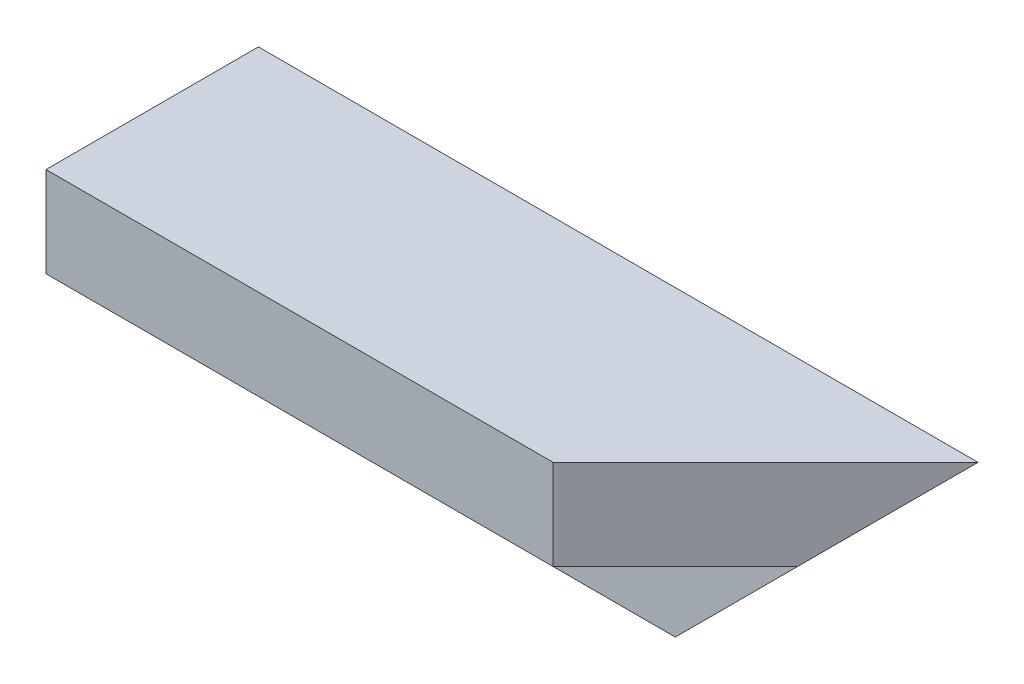
ISO-10303-21;
HEADER;
FILE_DESCRIPTION(('STEP AP214'),'2;1');
FILE_NAME('part.step','',(''),(''),'','','');
FILE_SCHEMA(('AUTOMOTIVE_DESIGN { 1 0 10303 214 1 1 1 1 }'));
ENDSEC;
DATA;
#1=APPLICATION_CONTEXT('core data for automotive mechanical design processes');
#2=APPLICATION_PROTOCOL_DEFINITION('international standard','automotive_design',2000,#1);
#3=PRODUCT_CONTEXT('',#1,'mechanical');
#4=PRODUCT('Part','Part','',(#3));
#5=PRODUCT_RELATED_PRODUCT_CATEGORY('part','',(#4));
#6=PRODUCT_DEFINITION_FORMATION('','',#4);
#7=PRODUCT_DEFINITION_CONTEXT('part definition',#1,'design');
#8=PRODUCT_DEFINITION('design','',#6,#7);
#9=PRODUCT_DEFINITION_SHAPE('','',#8);
#10=(LENGTH_UNIT() NAMED_UNIT(*) SI_UNIT(.MILLI.,.METRE.));
#11=(NAMED_UNIT(*) PLANE_ANGLE_UNIT() SI_UNIT($,.RADIAN.));
#12=(NAMED_UNIT(*) SI_UNIT($,.STERADIAN.) SOLID_ANGLE_UNIT());
#13=UNCERTAINTY_MEASURE_WITH_UNIT(LENGTH_MEASURE(1.E-05),#10,'distance_accuracy_value','');
#14=(GEOMETRIC_REPRESENTATION_CONTEXT(3) GLOBAL_UNCERTAINTY_ASSIGNED_CONTEXT((#13)) GLOBAL_UNIT_ASSIGNED_CONTEXT((#10,
#11,#12)) REPRESENTATION_CONTEXT('',''));
#15=CARTESIAN_POINT('',(0.,0.,0.));
#16=DIRECTION('',(0.,0.,1.));
#17=DIRECTION('',(1.,0.,0.));
#18=AXIS2_PLACEMENT_3D('',#15,#16,#17);
#19=CARTESIAN_POINT('',(219.000046471029,-40.,0.));
#20=DIRECTION('',(0.,0.,1.));
#21=DIRECTION('',(1.,0.,0.));
#22=AXIS2_PLACEMENT_3D('',#19,#20,#21);
#23=PLANE('',#22);
#24=DIRECTION('',(-1.,0.,0.));
#25=VECTOR('',#24,1.);
#26=CARTESIAN_POINT('',(219.000046471029,0.,0.));
#27=LINE('',#26,#25);
#28=CARTESIAN_POINT('',(219.000046471029,0.,0.));
#29=VERTEX_POINT('',#28);
#30=CARTESIAN_POINT('',(83.5000464711133,0.,0.));
#31=VERTEX_POINT('',#30);
#32=EDGE_CURVE('E40',#29,#31,#27,.T.);
#33=ORIENTED_EDGE('',*,*,#32,.F.);
#34=DIRECTION('',(0.707106781186548,0.707106781186547,0.));
#35=VECTOR('',#34,1.);
#36=CARTESIAN_POINT('',(219.000046471029,0.,0.));
#37=LINE('',#36,#35);
#38=CARTESIAN_POINT('',(179.000046471029,-40.,0.));
#39=VERTEX_POINT('',#38);
#40=EDGE_CURVE('E88',#39,#29,#37,.T.);
#41=ORIENTED_EDGE('',*,*,#40,.F.);
#42=DIRECTION('',(-1.,0.,0.));
#43=VECTOR('',#42,1.);
#44=CARTESIAN_POINT('',(219.000046471029,-40.,0.));
#45=LINE('',#44,#43);
#46=CARTESIAN_POINT('',(83.5000464711133,-40.,0.));
#47=VERTEX_POINT('',#46);
#48=EDGE_CURVE('E47',#39,#47,#45,.T.);
#49=ORIENTED_EDGE('',*,*,#48,.T.);
#50=DIRECTION('',(0.,1.,0.));
#51=VECTOR('',#50,1.);
#52=CARTESIAN_POINT('',(83.5000464711133,-40.,0.));
#53=LINE('',#52,#51);
#54=EDGE_CURVE('E118',#47,#31,#53,.T.);
#55=ORIENTED_EDGE('',*,*,#54,.T.);
#56=EDGE_LOOP('',(#33,#41,#49,#55));
#57=FACE_BOUND('',#56,.T.);
#58=ADVANCED_FACE('F33',(#57),#23,.F.);
#59=CARTESIAN_POINT('',(219.000046471029,0.,0.));
#60=DIRECTION('',(0.,-1.,0.));
#61=DIRECTION('',(0.,0.,-1.));
#62=AXIS2_PLACEMENT_3D('',#59,#60,#61);
#63=PLANE('',#62);
#64=DIRECTION('',(-1.,0.,0.));
#65=VECTOR('',#64,1.);
#66=CARTESIAN_POINT('',(219.000046471029,0.,40.));
#67=LINE('',#66,#65);
#68=CARTESIAN_POINT('',(179.000046471029,0.,40.));
#69=VERTEX_POINT('',#68);
#70=CARTESIAN_POINT('',(83.5000464711133,0.,40.));
#71=VERTEX_POINT('',#70);
#72=EDGE_CURVE('E109',#69,#71,#67,.T.);
#73=ORIENTED_EDGE('',*,*,#72,.F.);
#74=DIRECTION('',(-0.707106781186548,0.,0.707106781186547));
#75=VECTOR('',#74,1.);
#76=CARTESIAN_POINT('',(219.000046471029,0.,0.));
#77=LINE('',#76,#75);
#78=EDGE_CURVE('E117',#29,#69,#77,.T.);
#79=ORIENTED_EDGE('',*,*,#78,.F.);
#80=ORIENTED_EDGE('',*,*,#32,.T.);
#81=DIRECTION('',(0.,0.,1.));
#82=VECTOR('',#81,1.);
#83=CARTESIAN_POINT('',(83.5000464711133,0.,0.));
#84=LINE('',#83,#82);
#85=EDGE_CURVE('E115',#31,#71,#84,.T.);
#86=ORIENTED_EDGE('',*,*,#85,.T.);
#87=EDGE_LOOP('',(#73,#79,#80,#86));
#88=FACE_BOUND('',#87,.T.);
#89=ADVANCED_FACE('F114',(#88),#63,.F.);
#90=CARTESIAN_POINT('',(219.000046471029,0.,40.));
#91=DIRECTION('',(0.,0.,-1.));
#92=DIRECTION('',(-1.,0.,0.));
#93=AXIS2_PLACEMENT_3D('',#90,#91,#92);
#94=PLANE('',#93);
#95=DIRECTION('',(-1.,0.,0.));
#96=VECTOR('',#95,1.);
#97=CARTESIAN_POINT('',(219.000046471029,-17.,40.));
#98=LINE('',#97,#96);
#99=CARTESIAN_POINT('',(179.000046471029,-17.,40.));
#100=VERTEX_POINT('',#99);
#101=CARTESIAN_POINT('',(83.5000464711133,-17.,40.));
#102=VERTEX_POINT('',#101);
#103=EDGE_CURVE('E107',#100,#102,#98,.T.);
#104=ORIENTED_EDGE('',*,*,#103,.F.);
#105=DIRECTION('',(0.,1.,0.));
#106=VECTOR('',#105,1.);
#107=CARTESIAN_POINT('',(179.000046471029,-40.,40.));
#108=LINE('',#107,#106);
#109=EDGE_CURVE('E125',#100,#69,#108,.T.);
#110=ORIENTED_EDGE('',*,*,#109,.T.);
#111=ORIENTED_EDGE('',*,*,#72,.T.);
#112=DIRECTION('',(0.,-1.,0.));
#113=VECTOR('',#112,1.);
#114=CARTESIAN_POINT('',(83.5000464711133,0.,40.));
#115=LINE('',#114,#113);
#116=EDGE_CURVE('E122',#71,#102,#115,.T.);
#117=ORIENTED_EDGE('',*,*,#116,.T.);
#118=EDGE_LOOP('',(#104,#110,#111,#117));
#119=FACE_BOUND('',#118,.T.);
#120=ADVANCED_FACE('F153',(#119),#94,.F.);
#121=CARTESIAN_POINT('',(219.000046471029,-17.,40.));
#122=DIRECTION('',(0.,1.,0.));
#123=DIRECTION('',(0.,0.,1.));
#124=AXIS2_PLACEMENT_3D('',#121,#122,#123);
#125=PLANE('',#124);
#126=DIRECTION('',(-1.,0.,0.));
#127=VECTOR('',#126,1.);
#128=CARTESIAN_POINT('',(219.000046471029,-17.,17.));
#129=LINE('',#128,#127);
#130=CARTESIAN_POINT('',(202.000046471029,-17.,17.));
#131=VERTEX_POINT('',#130);
#132=CARTESIAN_POINT('',(83.5000464711133,-17.,17.));
#133=VERTEX_POINT('',#132);
#134=EDGE_CURVE('E100',#131,#133,#129,.T.);
#135=ORIENTED_EDGE('',*,*,#134,.F.);
#136=DIRECTION('',(-0.707106781186548,0.,0.707106781186548));
#137=VECTOR('',#136,1.);
#138=CARTESIAN_POINT('',(199.00004647103,-17.,20.));
#139=LINE('',#138,#137);
#140=EDGE_CURVE('E120',#131,#100,#139,.T.);
#141=ORIENTED_EDGE('',*,*,#140,.T.);
#142=ORIENTED_EDGE('',*,*,#103,.T.);
#143=DIRECTION('',(0.,0.,-1.));
#144=VECTOR('',#143,1.);
#145=CARTESIAN_POINT('',(83.5000464711133,-17.,40.));
#146=LINE('',#145,#144);
#147=EDGE_CURVE('E131',#102,#133,#146,.T.);
#148=ORIENTED_EDGE('',*,*,#147,.T.);
#149=EDGE_LOOP('',(#135,#141,#142,#148));
#150=FACE_BOUND('',#149,.T.);
#151=ADVANCED_FACE('F157',(#150),#125,.F.);
#152=CARTESIAN_POINT('',(219.000046471029,-17.,17.));
#153=DIRECTION('',(0.,0.,-1.));
#154=DIRECTION('',(0.,1.,0.));
#155=AXIS2_PLACEMENT_3D('',#152,#153,#154);
#156=PLANE('',#155);
#157=DIRECTION('',(-1.,0.,0.));
#158=VECTOR('',#157,1.);
#159=CARTESIAN_POINT('',(219.000046471029,-40.,17.));
#160=LINE('',#159,#158);
#161=CARTESIAN_POINT('',(179.000046471029,-40.,17.));
#162=VERTEX_POINT('',#161);
#163=CARTESIAN_POINT('',(83.5000464711133,-40.,17.));
#164=VERTEX_POINT('',#163);
#165=EDGE_CURVE('E54',#162,#164,#160,.T.);
#166=ORIENTED_EDGE('',*,*,#165,.F.);
#167=DIRECTION('',(0.707106781186548,0.707106781186547,0.));
#168=VECTOR('',#167,1.);
#169=CARTESIAN_POINT('',(210.500046471029,-8.5,17.));
#170=LINE('',#169,#168);
#171=EDGE_CURVE('E90',#162,#131,#170,.T.);
#172=ORIENTED_EDGE('',*,*,#171,.T.);
#173=ORIENTED_EDGE('',*,*,#134,.T.);
#174=DIRECTION('',(0.,-1.,0.));
#175=VECTOR('',#174,1.);
#176=CARTESIAN_POINT('',(83.5000464711133,-17.,17.));
#177=LINE('',#176,#175);
#178=EDGE_CURVE('E102',#133,#164,#177,.T.);
#179=ORIENTED_EDGE('',*,*,#178,.T.);
#180=EDGE_LOOP('',(#166,#172,#173,#179));
#181=FACE_BOUND('',#180,.T.);
#182=ADVANCED_FACE('F135',(#181),#156,.F.);
#183=CARTESIAN_POINT('',(219.000046471029,-40.,17.));
#184=DIRECTION('',(0.,1.,0.));
#185=DIRECTION('',(0.,0.,1.));
#186=AXIS2_PLACEMENT_3D('',#183,#184,#185);
#187=PLANE('',#186);
#188=ORIENTED_EDGE('',*,*,#48,.F.);
#189=DIRECTION('',(0.,0.,-1.));
#190=VECTOR('',#189,1.);
#191=CARTESIAN_POINT('',(179.000046471029,-40.,40.));
#192=LINE('',#191,#190);
#193=EDGE_CURVE('E86',#162,#39,#192,.T.);
#194=ORIENTED_EDGE('',*,*,#193,.F.);
#195=ORIENTED_EDGE('',*,*,#165,.T.);
#196=DIRECTION('',(0.,0.,-1.));
#197=VECTOR('',#196,1.);
#198=CARTESIAN_POINT('',(83.5000464711133,-40.,17.));
#199=LINE('',#198,#197);
#200=EDGE_CURVE('E97',#164,#47,#199,.T.);
#201=ORIENTED_EDGE('',*,*,#200,.T.);
#202=EDGE_LOOP('',(#188,#194,#195,#201));
#203=FACE_BOUND('',#202,.T.);
#204=ADVANCED_FACE('F95',(#203),#187,.F.);
#205=CARTESIAN_POINT('',(83.5000464711133,0.,0.));
#206=DIRECTION('',(1.,0.,0.));
#207=DIRECTION('',(0.,0.,-1.));
#208=AXIS2_PLACEMENT_3D('',#205,#206,#207);
#209=PLANE('',#208);
#210=ORIENTED_EDGE('',*,*,#54,.F.);
#211=ORIENTED_EDGE('',*,*,#200,.F.);
#212=ORIENTED_EDGE('',*,*,#178,.F.);
#213=ORIENTED_EDGE('',*,*,#147,.F.);
#214=ORIENTED_EDGE('',*,*,#116,.F.);
#215=ORIENTED_EDGE('',*,*,#85,.F.);
#216=EDGE_LOOP('',(#210,#211,#212,#213,#214,#215));
#217=FACE_BOUND('',#216,.T.);
#218=ADVANCED_FACE('F138',(#217),#209,.F.);
#219=CARTESIAN_POINT('',(219.000046471029,-40.,0.));
#220=DIRECTION('',(-0.707106781186548,0.,-0.707106781186548));
#221=DIRECTION('',(-0.707106781186548,0.,0.707106781186548));
#222=AXIS2_PLACEMENT_3D('',#219,#220,#221);
#223=PLANE('',#222);
#224=ORIENTED_EDGE('',*,*,#140,.F.);
#225=DIRECTION('',(0.577350269189626,0.577350269189626,-0.577350269189626));
#226=VECTOR('',#225,1.);
#227=CARTESIAN_POINT('',(205.666713137696,-13.3333333333333,13.3333333333333));
#228=LINE('',#227,#226);
#229=EDGE_CURVE('E11',#131,#29,#228,.T.);
#230=ORIENTED_EDGE('',*,*,#229,.T.);
#231=ORIENTED_EDGE('',*,*,#78,.T.);
#232=ORIENTED_EDGE('',*,*,#109,.F.);
#233=EDGE_LOOP('',(#224,#230,#231,#232));
#234=FACE_BOUND('',#233,.T.);
#235=ADVANCED_FACE('F140',(#234),#223,.F.);
#236=CARTESIAN_POINT('',(219.000046471029,0.,40.));
#237=DIRECTION('',(-0.707106781186547,0.707106781186548,0.));
#238=DIRECTION('',(-0.707106781186548,-0.707106781186547,0.));
#239=AXIS2_PLACEMENT_3D('',#236,#237,#238);
#240=PLANE('',#239);
#241=ORIENTED_EDGE('',*,*,#193,.T.);
#242=ORIENTED_EDGE('',*,*,#40,.T.);
#243=ORIENTED_EDGE('',*,*,#229,.F.);
#244=ORIENTED_EDGE('',*,*,#171,.F.);
#245=EDGE_LOOP('',(#241,#242,#243,#244));
#246=FACE_BOUND('',#245,.T.);
#247=ADVANCED_FACE('F87',(#246),#240,.F.);
#248=CLOSED_SHELL('',(#58,#89,#120,#151,#182,#204,#218,#235,#247));
#249=MANIFOLD_SOLID_BREP('B2',#248);
#250=ADVANCED_BREP_SHAPE_REPRESENTATION('',(#18,#249),#14);
#251=SHAPE_DEFINITION_REPRESENTATION(#9,#250);
ENDSEC;
END-ISO-10303-21;
